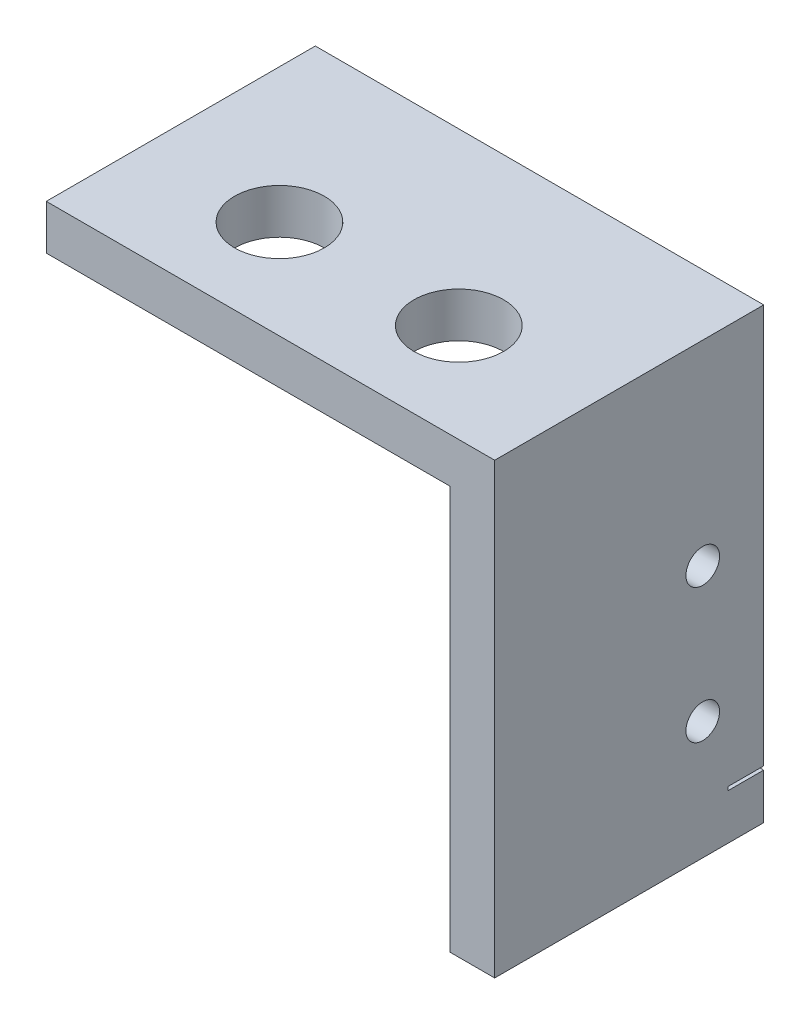
ISO-10303-21;
HEADER;
FILE_DESCRIPTION(('STEP AP214'),'2;1');
FILE_NAME('part.step','',(''),(''),'','','');
FILE_SCHEMA(('AUTOMOTIVE_DESIGN { 1 0 10303 214 1 1 1 1 }'));
ENDSEC;
DATA;
#1=APPLICATION_CONTEXT('core data for automotive mechanical design processes');
#2=APPLICATION_PROTOCOL_DEFINITION('international standard','automotive_design',2000,#1);
#3=PRODUCT_CONTEXT('',#1,'mechanical');
#4=PRODUCT('Part','Part','',(#3));
#5=PRODUCT_RELATED_PRODUCT_CATEGORY('part','',(#4));
#6=PRODUCT_DEFINITION_FORMATION('','',#4);
#7=PRODUCT_DEFINITION_CONTEXT('part definition',#1,'design');
#8=PRODUCT_DEFINITION('design','',#6,#7);
#9=PRODUCT_DEFINITION_SHAPE('','',#8);
#10=(LENGTH_UNIT() NAMED_UNIT(*) SI_UNIT(.MILLI.,.METRE.));
#11=(NAMED_UNIT(*) PLANE_ANGLE_UNIT() SI_UNIT($,.RADIAN.));
#12=(NAMED_UNIT(*) SI_UNIT($,.STERADIAN.) SOLID_ANGLE_UNIT());
#13=UNCERTAINTY_MEASURE_WITH_UNIT(LENGTH_MEASURE(1.E-05),#10,'distance_accuracy_value','');
#14=(GEOMETRIC_REPRESENTATION_CONTEXT(3) GLOBAL_UNCERTAINTY_ASSIGNED_CONTEXT((#13)) GLOBAL_UNIT_ASSIGNED_CONTEXT((#10,
#11,#12)) REPRESENTATION_CONTEXT('',''));
#15=CARTESIAN_POINT('',(0.,0.,0.));
#16=DIRECTION('',(0.,0.,1.));
#17=DIRECTION('',(1.,0.,0.));
#18=AXIS2_PLACEMENT_3D('',#15,#16,#17);
#19=CARTESIAN_POINT('',(0.,0.,0.));
#20=DIRECTION('',(0.,0.,1.));
#21=DIRECTION('',(1.,0.,0.));
#22=AXIS2_PLACEMENT_3D('',#19,#20,#21);
#23=PLANE('',#22);
#24=DIRECTION('',(0.,1.,0.));
#25=VECTOR('',#24,1.);
#26=CARTESIAN_POINT('',(0.,0.,0.));
#27=LINE('',#26,#25);
#28=CARTESIAN_POINT('',(0.,-25.0952,0.));
#29=VERTEX_POINT('',#28);
#30=CARTESIAN_POINT('',(0.,3.175,0.));
#31=VERTEX_POINT('',#30);
#32=EDGE_CURVE('E144',#29,#31,#27,.T.);
#33=ORIENTED_EDGE('',*,*,#32,.F.);
#34=DIRECTION('',(-1.,0.,0.));
#35=VECTOR('',#34,1.);
#36=CARTESIAN_POINT('',(0.00100000000000707,-25.0952,0.));
#37=LINE('',#36,#35);
#38=CARTESIAN_POINT('',(-3.175,-25.0952,0.));
#39=VERTEX_POINT('',#38);
#40=EDGE_CURVE('E164',#29,#39,#37,.T.);
#41=ORIENTED_EDGE('',*,*,#40,.T.);
#42=DIRECTION('',(0.,-1.,0.));
#43=VECTOR('',#42,1.);
#44=CARTESIAN_POINT('',(-3.175,0.,0.));
#45=LINE('',#44,#43);
#46=CARTESIAN_POINT('',(-3.175,0.,0.));
#47=VERTEX_POINT('',#46);
#48=EDGE_CURVE('E140',#47,#39,#45,.T.);
#49=ORIENTED_EDGE('',*,*,#48,.F.);
#50=DIRECTION('',(-1.,0.,0.));
#51=VECTOR('',#50,1.);
#52=CARTESIAN_POINT('',(0.,0.,0.));
#53=LINE('',#52,#51);
#54=CARTESIAN_POINT('',(-31.75,0.,0.));
#55=VERTEX_POINT('',#54);
#56=EDGE_CURVE('E135',#47,#55,#53,.T.);
#57=ORIENTED_EDGE('',*,*,#56,.T.);
#58=DIRECTION('',(0.,1.,0.));
#59=VECTOR('',#58,1.);
#60=CARTESIAN_POINT('',(-31.75,0.,0.));
#61=LINE('',#60,#59);
#62=CARTESIAN_POINT('',(-31.75,3.175,0.));
#63=VERTEX_POINT('',#62);
#64=EDGE_CURVE('E132',#55,#63,#61,.T.);
#65=ORIENTED_EDGE('',*,*,#64,.T.);
#66=DIRECTION('',(-1.,0.,0.));
#67=VECTOR('',#66,1.);
#68=CARTESIAN_POINT('',(0.,3.175,0.));
#69=LINE('',#68,#67);
#70=EDGE_CURVE('E147',#31,#63,#69,.T.);
#71=ORIENTED_EDGE('',*,*,#70,.F.);
#72=EDGE_LOOP('',(#33,#41,#49,#57,#65,#71));
#73=FACE_BOUND('',#72,.T.);
#74=ADVANCED_FACE('F35',(#73),#23,.F.);
#75=CARTESIAN_POINT('',(-31.75,0.,19.05));
#76=DIRECTION('',(-1.,0.,0.));
#77=DIRECTION('',(0.,0.,1.));
#78=AXIS2_PLACEMENT_3D('',#75,#76,#77);
#79=PLANE('',#78);
#80=ORIENTED_EDGE('',*,*,#64,.F.);
#81=DIRECTION('',(0.,0.,-1.));
#82=VECTOR('',#81,1.);
#83=CARTESIAN_POINT('',(-31.75,0.,19.05));
#84=LINE('',#83,#82);
#85=CARTESIAN_POINT('',(-31.75,0.,19.05));
#86=VERTEX_POINT('',#85);
#87=EDGE_CURVE('E11',#86,#55,#84,.T.);
#88=ORIENTED_EDGE('',*,*,#87,.F.);
#89=DIRECTION('',(0.,1.,0.));
#90=VECTOR('',#89,1.);
#91=CARTESIAN_POINT('',(-31.75,0.,19.05));
#92=LINE('',#91,#90);
#93=CARTESIAN_POINT('',(-31.75,3.175,19.05));
#94=VERTEX_POINT('',#93);
#95=EDGE_CURVE('E149',#86,#94,#92,.T.);
#96=ORIENTED_EDGE('',*,*,#95,.T.);
#97=DIRECTION('',(0.,0.,-1.));
#98=VECTOR('',#97,1.);
#99=CARTESIAN_POINT('',(-31.75,3.175,19.05));
#100=LINE('',#99,#98);
#101=EDGE_CURVE('E85',#94,#63,#100,.T.);
#102=ORIENTED_EDGE('',*,*,#101,.T.);
#103=EDGE_LOOP('',(#80,#88,#96,#102));
#104=FACE_BOUND('',#103,.T.);
#105=ADVANCED_FACE('F37',(#104),#79,.T.);
#106=CARTESIAN_POINT('',(0.,0.,19.05));
#107=DIRECTION('',(0.,-1.,0.));
#108=DIRECTION('',(1.,0.,0.));
#109=AXIS2_PLACEMENT_3D('',#106,#107,#108);
#110=PLANE('',#109);
#111=CARTESIAN_POINT('',(-22.225,0.,12.065));
#112=DIRECTION('',(0.,-1.,0.));
#113=DIRECTION('',(1.,0.,0.));
#114=AXIS2_PLACEMENT_3D('',#111,#112,#113);
#115=CIRCLE('',#114,3.175);
#116=CARTESIAN_POINT('',(-19.05,0.,12.065));
#117=VERTEX_POINT('',#116);
#118=EDGE_CURVE('E216',#117,#117,#115,.T.);
#119=ORIENTED_EDGE('',*,*,#118,.F.);
#120=EDGE_LOOP('',(#119));
#121=FACE_BOUND('',#120,.T.);
#122=CARTESIAN_POINT('',(-9.525,0.,12.065));
#123=DIRECTION('',(0.,-1.,0.));
#124=DIRECTION('',(1.,0.,0.));
#125=AXIS2_PLACEMENT_3D('',#122,#123,#124);
#126=CIRCLE('',#125,3.175);
#127=CARTESIAN_POINT('',(-6.35,0.,12.065));
#128=VERTEX_POINT('',#127);
#129=EDGE_CURVE('E210',#128,#128,#126,.T.);
#130=ORIENTED_EDGE('',*,*,#129,.F.);
#131=EDGE_LOOP('',(#130));
#132=FACE_BOUND('',#131,.T.);
#133=ORIENTED_EDGE('',*,*,#56,.F.);
#134=DIRECTION('',(0.,0.,-1.));
#135=VECTOR('',#134,1.);
#136=CARTESIAN_POINT('',(-3.175,0.,19.05));
#137=LINE('',#136,#135);
#138=CARTESIAN_POINT('',(-3.175,0.,19.05));
#139=VERTEX_POINT('',#138);
#140=EDGE_CURVE('E43',#139,#47,#137,.T.);
#141=ORIENTED_EDGE('',*,*,#140,.F.);
#142=DIRECTION('',(-1.,0.,0.));
#143=VECTOR('',#142,1.);
#144=CARTESIAN_POINT('',(0.,0.,19.05));
#145=LINE('',#144,#143);
#146=EDGE_CURVE('E127',#139,#86,#145,.T.);
#147=ORIENTED_EDGE('',*,*,#146,.T.);
#148=ORIENTED_EDGE('',*,*,#87,.T.);
#149=EDGE_LOOP('',(#133,#141,#147,#148));
#150=FACE_BOUND('',#149,.T.);
#151=ADVANCED_FACE('F165',(#121,#132,#150),#110,.T.);
#152=CARTESIAN_POINT('',(-3.175,0.,19.05));
#153=DIRECTION('',(1.,0.,0.));
#154=DIRECTION('',(0.,1.,0.));
#155=AXIS2_PLACEMENT_3D('',#152,#153,#154);
#156=PLANE('',#155);
#157=CARTESIAN_POINT('',(-3.175,-20.193,4.318));
#158=DIRECTION('',(-1.,0.,0.));
#159=DIRECTION('',(0.,-1.,0.));
#160=AXIS2_PLACEMENT_3D('',#157,#158,#159);
#161=CIRCLE('',#160,1.19062500000001);
#162=CARTESIAN_POINT('',(-3.175,-21.383625,4.318));
#163=VERTEX_POINT('',#162);
#164=EDGE_CURVE('E179',#163,#163,#161,.T.);
#165=ORIENTED_EDGE('',*,*,#164,.F.);
#166=EDGE_LOOP('',(#165));
#167=FACE_BOUND('',#166,.T.);
#168=CARTESIAN_POINT('',(-3.175,-10.668,4.318));
#169=DIRECTION('',(-1.,0.,0.));
#170=DIRECTION('',(0.,-1.,0.));
#171=AXIS2_PLACEMENT_3D('',#168,#169,#170);
#172=CIRCLE('',#171,1.190625);
#173=CARTESIAN_POINT('',(-3.175,-11.858625,4.318));
#174=VERTEX_POINT('',#173);
#175=EDGE_CURVE('E173',#174,#174,#172,.T.);
#176=ORIENTED_EDGE('',*,*,#175,.F.);
#177=EDGE_LOOP('',(#176));
#178=FACE_BOUND('',#177,.T.);
#179=ORIENTED_EDGE('',*,*,#48,.T.);
#180=DIRECTION('',(0.,0.,-1.));
#181=VECTOR('',#180,1.);
#182=CARTESIAN_POINT('',(-3.175,-25.0952,0.));
#183=LINE('',#182,#181);
#184=CARTESIAN_POINT('',(-3.175,-25.0952,2.54));
#185=VERTEX_POINT('',#184);
#186=EDGE_CURVE('E186',#185,#39,#183,.T.);
#187=ORIENTED_EDGE('',*,*,#186,.F.);
#188=DIRECTION('',(0.,1.,0.));
#189=VECTOR('',#188,1.);
#190=CARTESIAN_POINT('',(-3.175,-25.0952,2.54));
#191=LINE('',#190,#189);
#192=CARTESIAN_POINT('',(-3.175,-25.3492,2.54));
#193=VERTEX_POINT('',#192);
#194=EDGE_CURVE('E195',#193,#185,#191,.T.);
#195=ORIENTED_EDGE('',*,*,#194,.F.);
#196=DIRECTION('',(0.,0.,1.));
#197=VECTOR('',#196,1.);
#198=CARTESIAN_POINT('',(-3.175,-25.3492,0.));
#199=LINE('',#198,#197);
#200=CARTESIAN_POINT('',(-3.175,-25.3492,0.));
#201=VERTEX_POINT('',#200);
#202=EDGE_CURVE('E198',#201,#193,#199,.T.);
#203=ORIENTED_EDGE('',*,*,#202,.F.);
#204=CARTESIAN_POINT('',(-3.175,-28.575,0.));
#205=VERTEX_POINT('',#204);
#206=EDGE_CURVE('E139',#201,#205,#45,.T.);
#207=ORIENTED_EDGE('',*,*,#206,.T.);
#208=DIRECTION('',(0.,0.,-1.));
#209=VECTOR('',#208,1.);
#210=CARTESIAN_POINT('',(-3.175,-28.575,19.05));
#211=LINE('',#210,#209);
#212=CARTESIAN_POINT('',(-3.175,-28.575,19.05));
#213=VERTEX_POINT('',#212);
#214=EDGE_CURVE('E112',#213,#205,#211,.T.);
#215=ORIENTED_EDGE('',*,*,#214,.F.);
#216=DIRECTION('',(0.,-1.,0.));
#217=VECTOR('',#216,1.);
#218=CARTESIAN_POINT('',(-3.175,0.,19.05));
#219=LINE('',#218,#217);
#220=EDGE_CURVE('E124',#139,#213,#219,.T.);
#221=ORIENTED_EDGE('',*,*,#220,.F.);
#222=ORIENTED_EDGE('',*,*,#140,.T.);
#223=EDGE_LOOP('',(#179,#187,#195,#203,#207,#215,#221,#222));
#224=FACE_BOUND('',#223,.T.);
#225=ADVANCED_FACE('F154',(#167,#178,#224),#156,.F.);
#226=CARTESIAN_POINT('',(0.,-28.575,19.05));
#227=DIRECTION('',(0.,-1.,0.));
#228=DIRECTION('',(0.,0.,-1.));
#229=AXIS2_PLACEMENT_3D('',#226,#227,#228);
#230=PLANE('',#229);
#231=DIRECTION('',(-1.,0.,0.));
#232=VECTOR('',#231,1.);
#233=CARTESIAN_POINT('',(0.,-28.575,0.));
#234=LINE('',#233,#232);
#235=CARTESIAN_POINT('',(0.,-28.575,0.));
#236=VERTEX_POINT('',#235);
#237=EDGE_CURVE('E108',#236,#205,#234,.T.);
#238=ORIENTED_EDGE('',*,*,#237,.F.);
#239=DIRECTION('',(0.,0.,-1.));
#240=VECTOR('',#239,1.);
#241=CARTESIAN_POINT('',(0.,-28.575,19.05));
#242=LINE('',#241,#240);
#243=CARTESIAN_POINT('',(0.,-28.575,19.05));
#244=VERTEX_POINT('',#243);
#245=EDGE_CURVE('E101',#244,#236,#242,.T.);
#246=ORIENTED_EDGE('',*,*,#245,.F.);
#247=DIRECTION('',(-1.,0.,0.));
#248=VECTOR('',#247,1.);
#249=CARTESIAN_POINT('',(0.,-28.575,19.05));
#250=LINE('',#249,#248);
#251=EDGE_CURVE('E106',#244,#213,#250,.T.);
#252=ORIENTED_EDGE('',*,*,#251,.T.);
#253=ORIENTED_EDGE('',*,*,#214,.T.);
#254=EDGE_LOOP('',(#238,#246,#252,#253));
#255=FACE_BOUND('',#254,.T.);
#256=ADVANCED_FACE('F103',(#255),#230,.T.);
#257=CARTESIAN_POINT('',(0.,0.,19.05));
#258=DIRECTION('',(-1.,0.,0.));
#259=DIRECTION('',(0.,0.,1.));
#260=AXIS2_PLACEMENT_3D('',#257,#258,#259);
#261=PLANE('',#260);
#262=CARTESIAN_POINT('',(0.,-20.193,4.318));
#263=DIRECTION('',(-1.,0.,0.));
#264=DIRECTION('',(0.,0.,1.));
#265=AXIS2_PLACEMENT_3D('',#262,#263,#264);
#266=CIRCLE('',#265,1.19062500000001);
#267=CARTESIAN_POINT('',(0.,-20.193,5.50862500000001));
#268=VERTEX_POINT('',#267);
#269=EDGE_CURVE('E176',#268,#268,#266,.F.);
#270=ORIENTED_EDGE('',*,*,#269,.F.);
#271=EDGE_LOOP('',(#270));
#272=FACE_BOUND('',#271,.T.);
#273=CARTESIAN_POINT('',(0.,-10.668,4.318));
#274=DIRECTION('',(-1.,0.,0.));
#275=DIRECTION('',(0.,0.,1.));
#276=AXIS2_PLACEMENT_3D('',#273,#274,#275);
#277=CIRCLE('',#276,1.190625);
#278=CARTESIAN_POINT('',(0.,-10.668,5.508625));
#279=VERTEX_POINT('',#278);
#280=EDGE_CURVE('E136',#279,#279,#277,.F.);
#281=ORIENTED_EDGE('',*,*,#280,.F.);
#282=EDGE_LOOP('',(#281));
#283=FACE_BOUND('',#282,.T.);
#284=DIRECTION('',(0.,-1.,0.));
#285=VECTOR('',#284,1.);
#286=CARTESIAN_POINT('',(0.,-25.0952,2.54));
#287=LINE('',#286,#285);
#288=CARTESIAN_POINT('',(0.,-25.0952,2.54));
#289=VERTEX_POINT('',#288);
#290=CARTESIAN_POINT('',(0.,-25.3492,2.54));
#291=VERTEX_POINT('',#290);
#292=EDGE_CURVE('E204',#289,#291,#287,.T.);
#293=ORIENTED_EDGE('',*,*,#292,.F.);
#294=DIRECTION('',(0.,0.,1.));
#295=VECTOR('',#294,1.);
#296=CARTESIAN_POINT('',(0.,-25.0952,0.));
#297=LINE('',#296,#295);
#298=EDGE_CURVE('E201',#29,#289,#297,.T.);
#299=ORIENTED_EDGE('',*,*,#298,.F.);
#300=ORIENTED_EDGE('',*,*,#32,.T.);
#301=DIRECTION('',(0.,0.,-1.));
#302=VECTOR('',#301,1.);
#303=CARTESIAN_POINT('',(0.,3.175,19.05));
#304=LINE('',#303,#302);
#305=CARTESIAN_POINT('',(0.,3.175,19.05));
#306=VERTEX_POINT('',#305);
#307=EDGE_CURVE('E113',#306,#31,#304,.T.);
#308=ORIENTED_EDGE('',*,*,#307,.F.);
#309=DIRECTION('',(0.,1.,0.));
#310=VECTOR('',#309,1.);
#311=CARTESIAN_POINT('',(0.,0.,19.05));
#312=LINE('',#311,#310);
#313=EDGE_CURVE('E116',#244,#306,#312,.T.);
#314=ORIENTED_EDGE('',*,*,#313,.F.);
#315=ORIENTED_EDGE('',*,*,#245,.T.);
#316=CARTESIAN_POINT('',(0.,-25.3492,0.));
#317=VERTEX_POINT('',#316);
#318=EDGE_CURVE('E145',#236,#317,#27,.T.);
#319=ORIENTED_EDGE('',*,*,#318,.T.);
#320=DIRECTION('',(0.,0.,-1.));
#321=VECTOR('',#320,1.);
#322=CARTESIAN_POINT('',(0.,-25.3492,0.));
#323=LINE('',#322,#321);
#324=EDGE_CURVE('E50',#291,#317,#323,.T.);
#325=ORIENTED_EDGE('',*,*,#324,.F.);
#326=EDGE_LOOP('',(#293,#299,#300,#308,#314,#315,#319,#325));
#327=FACE_BOUND('',#326,.T.);
#328=ADVANCED_FACE('F118',(#272,#283,#327),#261,.F.);
#329=CARTESIAN_POINT('',(0.,3.175,19.05));
#330=DIRECTION('',(0.,-1.,0.));
#331=DIRECTION('',(1.,0.,0.));
#332=AXIS2_PLACEMENT_3D('',#329,#330,#331);
#333=PLANE('',#332);
#334=CARTESIAN_POINT('',(-22.225,3.175,12.065));
#335=DIRECTION('',(0.,-1.,0.));
#336=DIRECTION('',(1.,0.,0.));
#337=AXIS2_PLACEMENT_3D('',#334,#335,#336);
#338=CIRCLE('',#337,3.175);
#339=CARTESIAN_POINT('',(-19.05,3.175,12.065));
#340=VERTEX_POINT('',#339);
#341=EDGE_CURVE('E213',#340,#340,#338,.F.);
#342=ORIENTED_EDGE('',*,*,#341,.F.);
#343=EDGE_LOOP('',(#342));
#344=FACE_BOUND('',#343,.T.);
#345=CARTESIAN_POINT('',(-9.525,3.175,12.065));
#346=DIRECTION('',(0.,-1.,0.));
#347=DIRECTION('',(1.,0.,0.));
#348=AXIS2_PLACEMENT_3D('',#345,#346,#347);
#349=CIRCLE('',#348,3.175);
#350=CARTESIAN_POINT('',(-6.35,3.175,12.065));
#351=VERTEX_POINT('',#350);
#352=EDGE_CURVE('E207',#351,#351,#349,.F.);
#353=ORIENTED_EDGE('',*,*,#352,.F.);
#354=EDGE_LOOP('',(#353));
#355=FACE_BOUND('',#354,.T.);
#356=ORIENTED_EDGE('',*,*,#70,.T.);
#357=ORIENTED_EDGE('',*,*,#101,.F.);
#358=DIRECTION('',(-1.,0.,0.));
#359=VECTOR('',#358,1.);
#360=CARTESIAN_POINT('',(0.,3.175,19.05));
#361=LINE('',#360,#359);
#362=EDGE_CURVE('E59',#306,#94,#361,.T.);
#363=ORIENTED_EDGE('',*,*,#362,.F.);
#364=ORIENTED_EDGE('',*,*,#307,.T.);
#365=EDGE_LOOP('',(#356,#357,#363,#364));
#366=FACE_BOUND('',#365,.T.);
#367=ADVANCED_FACE('F168',(#344,#355,#366),#333,.F.);
#368=CARTESIAN_POINT('',(0.,0.,19.05));
#369=DIRECTION('',(0.,0.,1.));
#370=DIRECTION('',(1.,0.,0.));
#371=AXIS2_PLACEMENT_3D('',#368,#369,#370);
#372=PLANE('',#371);
#373=ORIENTED_EDGE('',*,*,#95,.F.);
#374=ORIENTED_EDGE('',*,*,#146,.F.);
#375=ORIENTED_EDGE('',*,*,#220,.T.);
#376=ORIENTED_EDGE('',*,*,#251,.F.);
#377=ORIENTED_EDGE('',*,*,#313,.T.);
#378=ORIENTED_EDGE('',*,*,#362,.T.);
#379=EDGE_LOOP('',(#373,#374,#375,#376,#377,#378));
#380=FACE_BOUND('',#379,.T.);
#381=ADVANCED_FACE('F121',(#380),#372,.T.);
#382=ORIENTED_EDGE('',*,*,#206,.F.);
#383=DIRECTION('',(-1.,0.,0.));
#384=VECTOR('',#383,1.);
#385=CARTESIAN_POINT('',(0.00100000000000707,-25.3492,0.));
#386=LINE('',#385,#384);
#387=EDGE_CURVE('E183',#317,#201,#386,.T.);
#388=ORIENTED_EDGE('',*,*,#387,.F.);
#389=ORIENTED_EDGE('',*,*,#318,.F.);
#390=ORIENTED_EDGE('',*,*,#237,.T.);
#391=EDGE_LOOP('',(#382,#388,#389,#390));
#392=FACE_BOUND('',#391,.T.);
#393=ADVANCED_FACE('F241',(#392),#23,.F.);
#394=CARTESIAN_POINT('',(0.00100000000000534,-10.668,4.318));
#395=DIRECTION('',(-1.,0.,0.));
#396=DIRECTION('',(0.,-1.,0.));
#397=AXIS2_PLACEMENT_3D('',#394,#395,#396);
#398=CYLINDRICAL_SURFACE('',#397,1.190625);
#399=ORIENTED_EDGE('',*,*,#175,.T.);
#400=EDGE_LOOP('',(#399));
#401=FACE_BOUND('',#400,.T.);
#402=ORIENTED_EDGE('',*,*,#280,.T.);
#403=EDGE_LOOP('',(#402));
#404=FACE_BOUND('',#403,.T.);
#405=ADVANCED_FACE('F252',(#401,#404),#398,.F.);
#406=CARTESIAN_POINT('',(0.00100000000000664,-20.193,4.318));
#407=DIRECTION('',(-1.,0.,0.));
#408=DIRECTION('',(0.,-1.,0.));
#409=AXIS2_PLACEMENT_3D('',#406,#407,#408);
#410=CYLINDRICAL_SURFACE('',#409,1.19062500000001);
#411=ORIENTED_EDGE('',*,*,#164,.T.);
#412=EDGE_LOOP('',(#411));
#413=FACE_BOUND('',#412,.T.);
#414=ORIENTED_EDGE('',*,*,#269,.T.);
#415=EDGE_LOOP('',(#414));
#416=FACE_BOUND('',#415,.T.);
#417=ADVANCED_FACE('F257',(#413,#416),#410,.F.);
#418=CARTESIAN_POINT('',(0.00100000000000707,-25.0952,0.));
#419=DIRECTION('',(0.,1.,0.));
#420=DIRECTION('',(-1.,0.,0.));
#421=AXIS2_PLACEMENT_3D('',#418,#419,#420);
#422=PLANE('',#421);
#423=ORIENTED_EDGE('',*,*,#298,.T.);
#424=DIRECTION('',(-1.,0.,0.));
#425=VECTOR('',#424,1.);
#426=CARTESIAN_POINT('',(0.00100000000000707,-25.0952,2.54));
#427=LINE('',#426,#425);
#428=EDGE_CURVE('E189',#289,#185,#427,.T.);
#429=ORIENTED_EDGE('',*,*,#428,.T.);
#430=ORIENTED_EDGE('',*,*,#186,.T.);
#431=ORIENTED_EDGE('',*,*,#40,.F.);
#432=EDGE_LOOP('',(#423,#429,#430,#431));
#433=FACE_BOUND('',#432,.T.);
#434=ADVANCED_FACE('F277',(#433),#422,.F.);
#435=CARTESIAN_POINT('',(0.00100000000000707,-25.0952,2.54));
#436=DIRECTION('',(0.,0.,1.));
#437=DIRECTION('',(0.,-1.,0.));
#438=AXIS2_PLACEMENT_3D('',#435,#436,#437);
#439=PLANE('',#438);
#440=ORIENTED_EDGE('',*,*,#292,.T.);
#441=DIRECTION('',(-1.,0.,0.));
#442=VECTOR('',#441,1.);
#443=CARTESIAN_POINT('',(0.00100000000000707,-25.3492,2.54));
#444=LINE('',#443,#442);
#445=EDGE_CURVE('E185',#291,#193,#444,.T.);
#446=ORIENTED_EDGE('',*,*,#445,.T.);
#447=ORIENTED_EDGE('',*,*,#194,.T.);
#448=ORIENTED_EDGE('',*,*,#428,.F.);
#449=EDGE_LOOP('',(#440,#446,#447,#448));
#450=FACE_BOUND('',#449,.T.);
#451=ADVANCED_FACE('F278',(#450),#439,.F.);
#452=CARTESIAN_POINT('',(0.00100000000000707,-25.3492,0.));
#453=DIRECTION('',(0.,-1.,0.));
#454=DIRECTION('',(0.,0.,-1.));
#455=AXIS2_PLACEMENT_3D('',#452,#453,#454);
#456=PLANE('',#455);
#457=ORIENTED_EDGE('',*,*,#324,.T.);
#458=ORIENTED_EDGE('',*,*,#387,.T.);
#459=ORIENTED_EDGE('',*,*,#202,.T.);
#460=ORIENTED_EDGE('',*,*,#445,.F.);
#461=EDGE_LOOP('',(#457,#458,#459,#460));
#462=FACE_BOUND('',#461,.T.);
#463=ADVANCED_FACE('F230',(#462),#456,.F.);
#464=CARTESIAN_POINT('',(-9.525,3.176,12.065));
#465=DIRECTION('',(0.,-1.,0.));
#466=DIRECTION('',(1.,0.,0.));
#467=AXIS2_PLACEMENT_3D('',#464,#465,#466);
#468=CYLINDRICAL_SURFACE('',#467,3.175);
#469=ORIENTED_EDGE('',*,*,#129,.T.);
#470=EDGE_LOOP('',(#469));
#471=FACE_BOUND('',#470,.T.);
#472=ORIENTED_EDGE('',*,*,#352,.T.);
#473=EDGE_LOOP('',(#472));
#474=FACE_BOUND('',#473,.T.);
#475=ADVANCED_FACE('F227',(#471,#474),#468,.F.);
#476=CARTESIAN_POINT('',(-22.225,3.176,12.065));
#477=DIRECTION('',(0.,-1.,0.));
#478=DIRECTION('',(1.,0.,0.));
#479=AXIS2_PLACEMENT_3D('',#476,#477,#478);
#480=CYLINDRICAL_SURFACE('',#479,3.175);
#481=ORIENTED_EDGE('',*,*,#118,.T.);
#482=EDGE_LOOP('',(#481));
#483=FACE_BOUND('',#482,.T.);
#484=ORIENTED_EDGE('',*,*,#341,.T.);
#485=EDGE_LOOP('',(#484));
#486=FACE_BOUND('',#485,.T.);
#487=ADVANCED_FACE('F220',(#483,#486),#480,.F.);
#488=CLOSED_SHELL('',(#74,#105,#151,#225,#256,#328,#367,#381,#393,#405,#417,#434,#451,#463,#475,#487));
#489=MANIFOLD_SOLID_BREP('B2',#488);
#490=ADVANCED_BREP_SHAPE_REPRESENTATION('',(#18,#489),#14);
#491=SHAPE_DEFINITION_REPRESENTATION(#9,#490);
ENDSEC;
END-ISO-10303-21;
